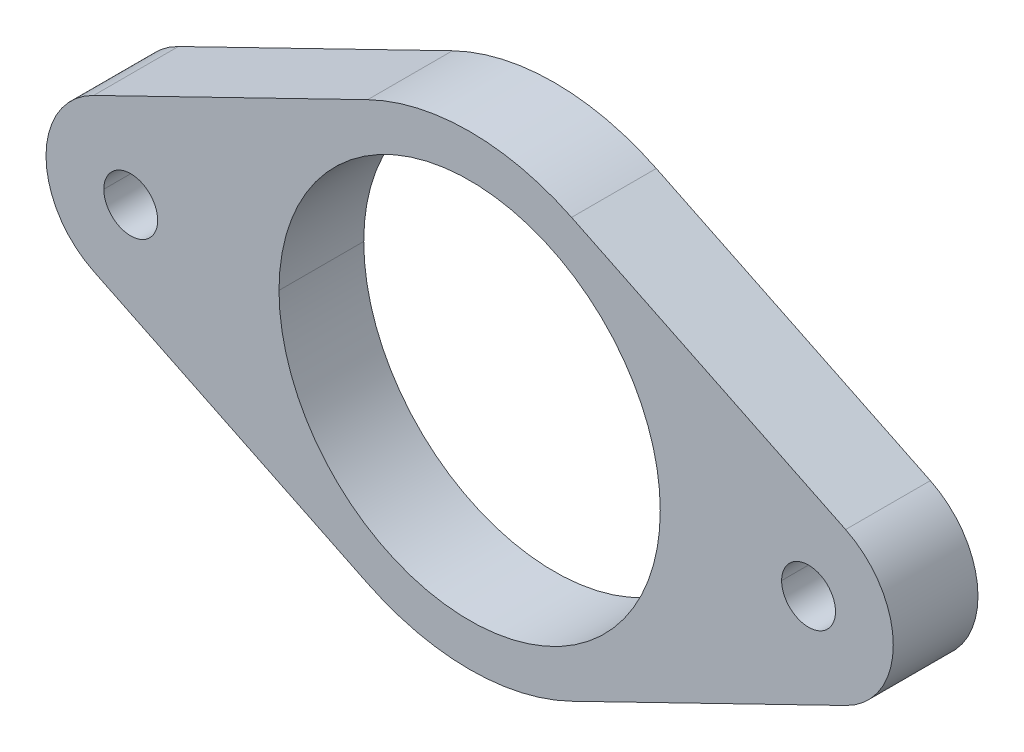
ISO-10303-21;
HEADER;
FILE_DESCRIPTION(('STEP AP214'),'2;1');
FILE_NAME('part.step','',(''),(''),'','','');
FILE_SCHEMA(('AUTOMOTIVE_DESIGN { 1 0 10303 214 1 1 1 1 }'));
ENDSEC;
DATA;
#1=APPLICATION_CONTEXT('core data for automotive mechanical design processes');
#2=APPLICATION_PROTOCOL_DEFINITION('international standard','automotive_design',2000,#1);
#3=PRODUCT_CONTEXT('',#1,'mechanical');
#4=PRODUCT('Part','Part','',(#3));
#5=PRODUCT_RELATED_PRODUCT_CATEGORY('part','',(#4));
#6=PRODUCT_DEFINITION_FORMATION('','',#4);
#7=PRODUCT_DEFINITION_CONTEXT('part definition',#1,'design');
#8=PRODUCT_DEFINITION('design','',#6,#7);
#9=PRODUCT_DEFINITION_SHAPE('','',#8);
#10=(LENGTH_UNIT() NAMED_UNIT(*) SI_UNIT(.MILLI.,.METRE.));
#11=(NAMED_UNIT(*) PLANE_ANGLE_UNIT() SI_UNIT($,.RADIAN.));
#12=(NAMED_UNIT(*) SI_UNIT($,.STERADIAN.) SOLID_ANGLE_UNIT());
#13=UNCERTAINTY_MEASURE_WITH_UNIT(LENGTH_MEASURE(1.E-05),#10,'distance_accuracy_value','');
#14=(GEOMETRIC_REPRESENTATION_CONTEXT(3) GLOBAL_UNCERTAINTY_ASSIGNED_CONTEXT((#13)) GLOBAL_UNIT_ASSIGNED_CONTEXT((#10,
#11,#12)) REPRESENTATION_CONTEXT('',''));
#15=CARTESIAN_POINT('',(0.,0.,0.));
#16=DIRECTION('',(0.,0.,1.));
#17=DIRECTION('',(1.,0.,0.));
#18=AXIS2_PLACEMENT_3D('',#15,#16,#17);
#19=CARTESIAN_POINT('',(-25.4,0.,3.175));
#20=DIRECTION('',(0.,0.,1.));
#21=DIRECTION('',(1.,0.,0.));
#22=AXIS2_PLACEMENT_3D('',#19,#20,#21);
#23=CYLINDRICAL_SURFACE('',#22,2.0193);
#24=DIRECTION('',(0.,0.,1.));
#25=VECTOR('',#24,1.);
#26=CARTESIAN_POINT('',(-27.4193,0.,3.175));
#27=LINE('',#26,#25);
#28=CARTESIAN_POINT('',(-27.4193,0.,-3.175));
#29=VERTEX_POINT('',#28);
#30=CARTESIAN_POINT('',(-27.4193,0.,3.175));
#31=VERTEX_POINT('',#30);
#32=EDGE_CURVE('E194',#29,#31,#27,.T.);
#33=ORIENTED_EDGE('',*,*,#32,.F.);
#34=CARTESIAN_POINT('',(-25.4,0.,-3.175));
#35=DIRECTION('',(0.,0.,1.));
#36=DIRECTION('',(1.,0.,0.));
#37=AXIS2_PLACEMENT_3D('',#34,#35,#36);
#38=CIRCLE('',#37,2.0193);
#39=CARTESIAN_POINT('',(-23.3807,0.,-3.175));
#40=VERTEX_POINT('',#39);
#41=EDGE_CURVE('E27',#40,#29,#38,.T.);
#42=ORIENTED_EDGE('',*,*,#41,.F.);
#43=DIRECTION('',(0.,0.,1.));
#44=VECTOR('',#43,1.);
#45=CARTESIAN_POINT('',(-23.3807,0.,3.175));
#46=LINE('',#45,#44);
#47=CARTESIAN_POINT('',(-23.3807,0.,3.175));
#48=VERTEX_POINT('',#47);
#49=EDGE_CURVE('E267',#40,#48,#46,.T.);
#50=ORIENTED_EDGE('',*,*,#49,.T.);
#51=CARTESIAN_POINT('',(-25.4,0.,3.175));
#52=DIRECTION('',(0.,0.,1.));
#53=DIRECTION('',(1.,0.,0.));
#54=AXIS2_PLACEMENT_3D('',#51,#52,#53);
#55=CIRCLE('',#54,2.0193);
#56=EDGE_CURVE('E247',#48,#31,#55,.T.);
#57=ORIENTED_EDGE('',*,*,#56,.T.);
#58=EDGE_LOOP('',(#33,#42,#50,#57));
#59=FACE_BOUND('',#58,.T.);
#60=ADVANCED_FACE('F16',(#59),#23,.F.);
#61=CARTESIAN_POINT('',(25.4,0.,3.175));
#62=DIRECTION('',(0.,0.,1.));
#63=DIRECTION('',(1.,0.,0.));
#64=AXIS2_PLACEMENT_3D('',#61,#62,#63);
#65=CYLINDRICAL_SURFACE('',#64,2.0193);
#66=DIRECTION('',(0.,0.,1.));
#67=VECTOR('',#66,1.);
#68=CARTESIAN_POINT('',(23.3807,0.,3.175));
#69=LINE('',#68,#67);
#70=CARTESIAN_POINT('',(23.3807,0.,-3.175));
#71=VERTEX_POINT('',#70);
#72=CARTESIAN_POINT('',(23.3807,0.,3.175));
#73=VERTEX_POINT('',#72);
#74=EDGE_CURVE('E266',#71,#73,#69,.T.);
#75=ORIENTED_EDGE('',*,*,#74,.F.);
#76=CARTESIAN_POINT('',(25.4,0.,-3.175));
#77=DIRECTION('',(0.,0.,1.));
#78=DIRECTION('',(1.,0.,0.));
#79=AXIS2_PLACEMENT_3D('',#76,#77,#78);
#80=CIRCLE('',#79,2.0193);
#81=CARTESIAN_POINT('',(27.4193,0.,-3.175));
#82=VERTEX_POINT('',#81);
#83=EDGE_CURVE('E11',#82,#71,#80,.T.);
#84=ORIENTED_EDGE('',*,*,#83,.F.);
#85=DIRECTION('',(0.,0.,1.));
#86=VECTOR('',#85,1.);
#87=CARTESIAN_POINT('',(27.4193,0.,3.175));
#88=LINE('',#87,#86);
#89=CARTESIAN_POINT('',(27.4193,0.,3.175));
#90=VERTEX_POINT('',#89);
#91=EDGE_CURVE('E181',#82,#90,#88,.T.);
#92=ORIENTED_EDGE('',*,*,#91,.T.);
#93=CARTESIAN_POINT('',(25.4,0.,3.175));
#94=DIRECTION('',(0.,0.,1.));
#95=DIRECTION('',(1.,0.,0.));
#96=AXIS2_PLACEMENT_3D('',#93,#94,#95);
#97=CIRCLE('',#96,2.0193);
#98=EDGE_CURVE('E301',#90,#73,#97,.T.);
#99=ORIENTED_EDGE('',*,*,#98,.T.);
#100=EDGE_LOOP('',(#75,#84,#92,#99));
#101=FACE_BOUND('',#100,.T.);
#102=ADVANCED_FACE('F372',(#101),#65,.F.);
#103=CARTESIAN_POINT('',(0.,0.,-3.175));
#104=DIRECTION('',(0.,0.,1.));
#105=DIRECTION('',(1.,0.,0.));
#106=AXIS2_PLACEMENT_3D('',#103,#104,#105);
#107=PLANE('',#106);
#108=CARTESIAN_POINT('',(0.,0.,-3.175));
#109=DIRECTION('',(0.,0.,1.));
#110=DIRECTION('',(1.,0.,0.));
#111=AXIS2_PLACEMENT_3D('',#108,#109,#110);
#112=CIRCLE('',#111,14.2875);
#113=CARTESIAN_POINT('',(-14.2875,0.,-3.175));
#114=VERTEX_POINT('',#113);
#115=CARTESIAN_POINT('',(14.2875,0.,-3.175));
#116=VERTEX_POINT('',#115);
#117=EDGE_CURVE('E176',#114,#116,#112,.T.);
#118=ORIENTED_EDGE('',*,*,#117,.T.);
#119=CARTESIAN_POINT('',(0.,0.,-3.175));
#120=DIRECTION('',(0.,0.,1.));
#121=DIRECTION('',(1.,0.,0.));
#122=AXIS2_PLACEMENT_3D('',#119,#120,#121);
#123=CIRCLE('',#122,14.2875);
#124=EDGE_CURVE('E166',#116,#114,#123,.T.);
#125=ORIENTED_EDGE('',*,*,#124,.T.);
#126=EDGE_LOOP('',(#118,#125));
#127=FACE_BOUND('',#126,.T.);
#128=ORIENTED_EDGE('',*,*,#83,.T.);
#129=CARTESIAN_POINT('',(25.4,0.,-3.175));
#130=DIRECTION('',(0.,0.,1.));
#131=DIRECTION('',(1.,0.,0.));
#132=AXIS2_PLACEMENT_3D('',#129,#130,#131);
#133=CIRCLE('',#132,2.0193);
#134=EDGE_CURVE('E262',#71,#82,#133,.T.);
#135=ORIENTED_EDGE('',*,*,#134,.T.);
#136=EDGE_LOOP('',(#128,#135));
#137=FACE_BOUND('',#136,.T.);
#138=ORIENTED_EDGE('',*,*,#41,.T.);
#139=CARTESIAN_POINT('',(-25.4,0.,-3.175));
#140=DIRECTION('',(0.,0.,1.));
#141=DIRECTION('',(1.,0.,0.));
#142=AXIS2_PLACEMENT_3D('',#139,#140,#141);
#143=CIRCLE('',#142,2.0193);
#144=EDGE_CURVE('E198',#29,#40,#143,.T.);
#145=ORIENTED_EDGE('',*,*,#144,.T.);
#146=EDGE_LOOP('',(#138,#145));
#147=FACE_BOUND('',#146,.T.);
#148=DIRECTION('',(-0.899218410621135,0.4375,0.));
#149=VECTOR('',#148,1.);
#150=CARTESIAN_POINT('',(7.63984375,15.7026014954715,-3.175));
#151=LINE('',#150,#149);
#152=CARTESIAN_POINT('',(28.178125,5.71003690744421,-3.175));
#153=VERTEX_POINT('',#152);
#154=CARTESIAN_POINT('',(7.63984375,15.7026014954715,-3.175));
#155=VERTEX_POINT('',#154);
#156=EDGE_CURVE('E199',#153,#155,#151,.T.);
#157=ORIENTED_EDGE('',*,*,#156,.F.);
#158=CARTESIAN_POINT('',(25.4,0.,-3.175));
#159=DIRECTION('',(0.,0.,1.));
#160=DIRECTION('',(1.,0.,0.));
#161=AXIS2_PLACEMENT_3D('',#158,#159,#160);
#162=CIRCLE('',#161,6.35);
#163=CARTESIAN_POINT('',(28.178125,-5.71003690744421,-3.175));
#164=VERTEX_POINT('',#163);
#165=EDGE_CURVE('E248',#164,#153,#162,.T.);
#166=ORIENTED_EDGE('',*,*,#165,.F.);
#167=DIRECTION('',(-0.899218410621135,-0.4375,0.));
#168=VECTOR('',#167,1.);
#169=CARTESIAN_POINT('',(7.63984375,-15.7026014954715,-3.175));
#170=LINE('',#169,#168);
#171=CARTESIAN_POINT('',(7.63984375,-15.7026014954715,-3.175));
#172=VERTEX_POINT('',#171);
#173=EDGE_CURVE('E228',#164,#172,#170,.T.);
#174=ORIENTED_EDGE('',*,*,#173,.T.);
#175=CARTESIAN_POINT('',(0.,0.,-3.175));
#176=DIRECTION('',(0.,0.,1.));
#177=DIRECTION('',(1.,0.,0.));
#178=AXIS2_PLACEMENT_3D('',#175,#176,#177);
#179=CIRCLE('',#178,17.4625);
#180=CARTESIAN_POINT('',(-7.63984375,-15.7026014954715,-3.175));
#181=VERTEX_POINT('',#180);
#182=EDGE_CURVE('E284',#181,#172,#179,.T.);
#183=ORIENTED_EDGE('',*,*,#182,.F.);
#184=DIRECTION('',(-0.899218410621135,0.4375,0.));
#185=VECTOR('',#184,1.);
#186=CARTESIAN_POINT('',(-7.63984375,-15.7026014954715,-3.175));
#187=LINE('',#186,#185);
#188=CARTESIAN_POINT('',(-28.178125,-5.71003690744421,-3.175));
#189=VERTEX_POINT('',#188);
#190=EDGE_CURVE('E258',#181,#189,#187,.T.);
#191=ORIENTED_EDGE('',*,*,#190,.T.);
#192=CARTESIAN_POINT('',(-25.4,0.,-3.175));
#193=DIRECTION('',(0.,0.,1.));
#194=DIRECTION('',(1.,0.,0.));
#195=AXIS2_PLACEMENT_3D('',#192,#193,#194);
#196=CIRCLE('',#195,6.35);
#197=CARTESIAN_POINT('',(-31.75,0.,-3.175));
#198=VERTEX_POINT('',#197);
#199=EDGE_CURVE('E215',#198,#189,#196,.T.);
#200=ORIENTED_EDGE('',*,*,#199,.F.);
#201=CARTESIAN_POINT('',(-25.4,0.,-3.175));
#202=DIRECTION('',(0.,0.,1.));
#203=DIRECTION('',(1.,0.,0.));
#204=AXIS2_PLACEMENT_3D('',#201,#202,#203);
#205=CIRCLE('',#204,6.35);
#206=CARTESIAN_POINT('',(-28.178125,5.71003690744421,-3.175));
#207=VERTEX_POINT('',#206);
#208=EDGE_CURVE('E261',#207,#198,#205,.T.);
#209=ORIENTED_EDGE('',*,*,#208,.F.);
#210=DIRECTION('',(0.899218410621135,0.4375,0.));
#211=VECTOR('',#210,1.);
#212=CARTESIAN_POINT('',(-7.63984375,15.7026014954715,-3.175));
#213=LINE('',#212,#211);
#214=CARTESIAN_POINT('',(-7.63984375,15.7026014954715,-3.175));
#215=VERTEX_POINT('',#214);
#216=EDGE_CURVE('E241',#207,#215,#213,.T.);
#217=ORIENTED_EDGE('',*,*,#216,.T.);
#218=CARTESIAN_POINT('',(0.,0.,-3.175));
#219=DIRECTION('',(0.,0.,1.));
#220=DIRECTION('',(1.,0.,0.));
#221=AXIS2_PLACEMENT_3D('',#218,#219,#220);
#222=CIRCLE('',#221,17.4625);
#223=EDGE_CURVE('E238',#155,#215,#222,.T.);
#224=ORIENTED_EDGE('',*,*,#223,.F.);
#225=EDGE_LOOP('',(#157,#166,#174,#183,#191,#200,#209,#217,#224));
#226=FACE_BOUND('',#225,.T.);
#227=ADVANCED_FACE('F320',(#127,#137,#147,#226),#107,.F.);
#228=CARTESIAN_POINT('',(0.,0.,3.175));
#229=DIRECTION('',(0.,0.,1.));
#230=DIRECTION('',(1.,0.,0.));
#231=AXIS2_PLACEMENT_3D('',#228,#229,#230);
#232=PLANE('',#231);
#233=CARTESIAN_POINT('',(0.,0.,3.175));
#234=DIRECTION('',(0.,0.,1.));
#235=DIRECTION('',(1.,0.,0.));
#236=AXIS2_PLACEMENT_3D('',#233,#234,#235);
#237=CIRCLE('',#236,14.2875);
#238=CARTESIAN_POINT('',(-14.2875,0.,3.175));
#239=VERTEX_POINT('',#238);
#240=CARTESIAN_POINT('',(14.2875,0.,3.175));
#241=VERTEX_POINT('',#240);
#242=EDGE_CURVE('E161',#239,#241,#237,.T.);
#243=ORIENTED_EDGE('',*,*,#242,.F.);
#244=CARTESIAN_POINT('',(0.,0.,3.175));
#245=DIRECTION('',(0.,0.,1.));
#246=DIRECTION('',(1.,0.,0.));
#247=AXIS2_PLACEMENT_3D('',#244,#245,#246);
#248=CIRCLE('',#247,14.2875);
#249=EDGE_CURVE('E156',#241,#239,#248,.T.);
#250=ORIENTED_EDGE('',*,*,#249,.F.);
#251=EDGE_LOOP('',(#243,#250));
#252=FACE_BOUND('',#251,.T.);
#253=ORIENTED_EDGE('',*,*,#98,.F.);
#254=CARTESIAN_POINT('',(25.4,0.,3.175));
#255=DIRECTION('',(0.,0.,1.));
#256=DIRECTION('',(1.,0.,0.));
#257=AXIS2_PLACEMENT_3D('',#254,#255,#256);
#258=CIRCLE('',#257,2.0193);
#259=EDGE_CURVE('E188',#73,#90,#258,.T.);
#260=ORIENTED_EDGE('',*,*,#259,.F.);
#261=EDGE_LOOP('',(#253,#260));
#262=FACE_BOUND('',#261,.T.);
#263=ORIENTED_EDGE('',*,*,#56,.F.);
#264=CARTESIAN_POINT('',(-25.4,0.,3.175));
#265=DIRECTION('',(0.,0.,1.));
#266=DIRECTION('',(1.,0.,0.));
#267=AXIS2_PLACEMENT_3D('',#264,#265,#266);
#268=CIRCLE('',#267,2.0193);
#269=EDGE_CURVE('E197',#31,#48,#268,.T.);
#270=ORIENTED_EDGE('',*,*,#269,.F.);
#271=EDGE_LOOP('',(#263,#270));
#272=FACE_BOUND('',#271,.T.);
#273=DIRECTION('',(-0.899218410621135,0.4375,0.));
#274=VECTOR('',#273,1.);
#275=CARTESIAN_POINT('',(7.63984375,15.7026014954715,3.175));
#276=LINE('',#275,#274);
#277=CARTESIAN_POINT('',(28.178125,5.71003690744421,3.175));
#278=VERTEX_POINT('',#277);
#279=CARTESIAN_POINT('',(7.63984375,15.7026014954715,3.175));
#280=VERTEX_POINT('',#279);
#281=EDGE_CURVE('E213',#278,#280,#276,.T.);
#282=ORIENTED_EDGE('',*,*,#281,.T.);
#283=CARTESIAN_POINT('',(0.,0.,3.175));
#284=DIRECTION('',(0.,0.,1.));
#285=DIRECTION('',(1.,0.,0.));
#286=AXIS2_PLACEMENT_3D('',#283,#284,#285);
#287=CIRCLE('',#286,17.4625);
#288=CARTESIAN_POINT('',(-7.63984375,15.7026014954715,3.175));
#289=VERTEX_POINT('',#288);
#290=EDGE_CURVE('E237',#280,#289,#287,.T.);
#291=ORIENTED_EDGE('',*,*,#290,.T.);
#292=DIRECTION('',(0.899218410621135,0.4375,0.));
#293=VECTOR('',#292,1.);
#294=CARTESIAN_POINT('',(-7.63984375,15.7026014954715,3.175));
#295=LINE('',#294,#293);
#296=CARTESIAN_POINT('',(-28.178125,5.71003690744421,3.175));
#297=VERTEX_POINT('',#296);
#298=EDGE_CURVE('E288',#297,#289,#295,.T.);
#299=ORIENTED_EDGE('',*,*,#298,.F.);
#300=CARTESIAN_POINT('',(-25.4,0.,3.175));
#301=DIRECTION('',(0.,0.,1.));
#302=DIRECTION('',(1.,0.,0.));
#303=AXIS2_PLACEMENT_3D('',#300,#301,#302);
#304=CIRCLE('',#303,6.35);
#305=CARTESIAN_POINT('',(-31.75,0.,3.175));
#306=VERTEX_POINT('',#305);
#307=EDGE_CURVE('E20',#297,#306,#304,.T.);
#308=ORIENTED_EDGE('',*,*,#307,.T.);
#309=CARTESIAN_POINT('',(-25.4,0.,3.175));
#310=DIRECTION('',(0.,0.,1.));
#311=DIRECTION('',(1.,0.,0.));
#312=AXIS2_PLACEMENT_3D('',#309,#310,#311);
#313=CIRCLE('',#312,6.35);
#314=CARTESIAN_POINT('',(-28.178125,-5.71003690744421,3.175));
#315=VERTEX_POINT('',#314);
#316=EDGE_CURVE('E252',#306,#315,#313,.T.);
#317=ORIENTED_EDGE('',*,*,#316,.T.);
#318=DIRECTION('',(-0.899218410621135,0.4375,0.));
#319=VECTOR('',#318,1.);
#320=CARTESIAN_POINT('',(-7.63984375,-15.7026014954715,3.175));
#321=LINE('',#320,#319);
#322=CARTESIAN_POINT('',(-7.63984375,-15.7026014954715,3.175));
#323=VERTEX_POINT('',#322);
#324=EDGE_CURVE('E257',#323,#315,#321,.T.);
#325=ORIENTED_EDGE('',*,*,#324,.F.);
#326=CARTESIAN_POINT('',(0.,0.,3.175));
#327=DIRECTION('',(0.,0.,1.));
#328=DIRECTION('',(1.,0.,0.));
#329=AXIS2_PLACEMENT_3D('',#326,#327,#328);
#330=CIRCLE('',#329,17.4625);
#331=CARTESIAN_POINT('',(7.63984375,-15.7026014954715,3.175));
#332=VERTEX_POINT('',#331);
#333=EDGE_CURVE('E283',#323,#332,#330,.T.);
#334=ORIENTED_EDGE('',*,*,#333,.T.);
#335=DIRECTION('',(-0.899218410621135,-0.4375,0.));
#336=VECTOR('',#335,1.);
#337=CARTESIAN_POINT('',(7.63984375,-15.7026014954715,3.175));
#338=LINE('',#337,#336);
#339=CARTESIAN_POINT('',(28.178125,-5.71003690744421,3.175));
#340=VERTEX_POINT('',#339);
#341=EDGE_CURVE('E167',#340,#332,#338,.T.);
#342=ORIENTED_EDGE('',*,*,#341,.F.);
#343=CARTESIAN_POINT('',(25.4,0.,3.175));
#344=DIRECTION('',(0.,0.,1.));
#345=DIRECTION('',(1.,0.,0.));
#346=AXIS2_PLACEMENT_3D('',#343,#344,#345);
#347=CIRCLE('',#346,6.35);
#348=EDGE_CURVE('E41',#340,#278,#347,.T.);
#349=ORIENTED_EDGE('',*,*,#348,.T.);
#350=EDGE_LOOP('',(#282,#291,#299,#308,#317,#325,#334,#342,#349));
#351=FACE_BOUND('',#350,.T.);
#352=ADVANCED_FACE('F158',(#252,#262,#272,#351),#232,.T.);
#353=CARTESIAN_POINT('',(25.4,0.,3.175));
#354=DIRECTION('',(0.,0.,-1.));
#355=DIRECTION('',(-1.,0.,0.));
#356=AXIS2_PLACEMENT_3D('',#353,#354,#355);
#357=CYLINDRICAL_SURFACE('',#356,6.35);
#358=ORIENTED_EDGE('',*,*,#165,.T.);
#359=DIRECTION('',(0.,0.,-1.));
#360=VECTOR('',#359,1.);
#361=CARTESIAN_POINT('',(28.178125,5.71003690744421,3.175));
#362=LINE('',#361,#360);
#363=EDGE_CURVE('E327',#278,#153,#362,.T.);
#364=ORIENTED_EDGE('',*,*,#363,.F.);
#365=ORIENTED_EDGE('',*,*,#348,.F.);
#366=DIRECTION('',(0.,0.,-1.));
#367=VECTOR('',#366,1.);
#368=CARTESIAN_POINT('',(28.178125,-5.71003690744421,3.175));
#369=LINE('',#368,#367);
#370=EDGE_CURVE('E230',#340,#164,#369,.T.);
#371=ORIENTED_EDGE('',*,*,#370,.T.);
#372=EDGE_LOOP('',(#358,#364,#365,#371));
#373=FACE_BOUND('',#372,.T.);
#374=ADVANCED_FACE('F319',(#373),#357,.T.);
#375=CARTESIAN_POINT('',(0.,0.,3.175));
#376=DIRECTION('',(0.,0.,-1.));
#377=DIRECTION('',(-1.,0.,0.));
#378=AXIS2_PLACEMENT_3D('',#375,#376,#377);
#379=CYLINDRICAL_SURFACE('',#378,14.2875);
#380=DIRECTION('',(0.,0.,-1.));
#381=VECTOR('',#380,1.);
#382=CARTESIAN_POINT('',(14.2875,0.,3.175));
#383=LINE('',#382,#381);
#384=EDGE_CURVE('E170',#241,#116,#383,.T.);
#385=ORIENTED_EDGE('',*,*,#384,.F.);
#386=ORIENTED_EDGE('',*,*,#249,.T.);
#387=DIRECTION('',(0.,0.,-1.));
#388=VECTOR('',#387,1.);
#389=CARTESIAN_POINT('',(-14.2875,0.,3.175));
#390=LINE('',#389,#388);
#391=EDGE_CURVE('E179',#239,#114,#390,.T.);
#392=ORIENTED_EDGE('',*,*,#391,.T.);
#393=ORIENTED_EDGE('',*,*,#124,.F.);
#394=EDGE_LOOP('',(#385,#386,#392,#393));
#395=FACE_BOUND('',#394,.T.);
#396=ADVANCED_FACE('F171',(#395),#379,.F.);
#397=CARTESIAN_POINT('',(7.63984375,-15.7026014954715,3.175));
#398=DIRECTION('',(0.4375,-0.899218410621135,0.));
#399=DIRECTION('',(0.,0.,-1.));
#400=AXIS2_PLACEMENT_3D('',#397,#398,#399);
#401=PLANE('',#400);
#402=ORIENTED_EDGE('',*,*,#173,.F.);
#403=ORIENTED_EDGE('',*,*,#370,.F.);
#404=ORIENTED_EDGE('',*,*,#341,.T.);
#405=DIRECTION('',(0.,0.,-1.));
#406=VECTOR('',#405,1.);
#407=CARTESIAN_POINT('',(7.63984375,-15.7026014954715,3.175));
#408=LINE('',#407,#406);
#409=EDGE_CURVE('E279',#332,#172,#408,.T.);
#410=ORIENTED_EDGE('',*,*,#409,.T.);
#411=EDGE_LOOP('',(#402,#403,#404,#410));
#412=FACE_BOUND('',#411,.T.);
#413=ADVANCED_FACE('F453',(#412),#401,.T.);
#414=CARTESIAN_POINT('',(0.,0.,3.175));
#415=DIRECTION('',(0.,0.,-1.));
#416=DIRECTION('',(-1.,0.,0.));
#417=AXIS2_PLACEMENT_3D('',#414,#415,#416);
#418=CYLINDRICAL_SURFACE('',#417,17.4625);
#419=ORIENTED_EDGE('',*,*,#182,.T.);
#420=ORIENTED_EDGE('',*,*,#409,.F.);
#421=ORIENTED_EDGE('',*,*,#333,.F.);
#422=DIRECTION('',(0.,0.,-1.));
#423=VECTOR('',#422,1.);
#424=CARTESIAN_POINT('',(-7.63984375,-15.7026014954715,3.175));
#425=LINE('',#424,#423);
#426=EDGE_CURVE('E253',#323,#181,#425,.T.);
#427=ORIENTED_EDGE('',*,*,#426,.T.);
#428=EDGE_LOOP('',(#419,#420,#421,#427));
#429=FACE_BOUND('',#428,.T.);
#430=ADVANCED_FACE('F351',(#429),#418,.T.);
#431=CARTESIAN_POINT('',(-7.63984375,-15.7026014954715,3.175));
#432=DIRECTION('',(-0.4375,-0.899218410621135,0.));
#433=DIRECTION('',(-0.899218410621135,0.4375,0.));
#434=AXIS2_PLACEMENT_3D('',#431,#432,#433);
#435=PLANE('',#434);
#436=ORIENTED_EDGE('',*,*,#190,.F.);
#437=ORIENTED_EDGE('',*,*,#426,.F.);
#438=ORIENTED_EDGE('',*,*,#324,.T.);
#439=DIRECTION('',(0.,0.,-1.));
#440=VECTOR('',#439,1.);
#441=CARTESIAN_POINT('',(-28.178125,-5.71003690744421,3.175));
#442=LINE('',#441,#440);
#443=EDGE_CURVE('E203',#315,#189,#442,.T.);
#444=ORIENTED_EDGE('',*,*,#443,.T.);
#445=EDGE_LOOP('',(#436,#437,#438,#444));
#446=FACE_BOUND('',#445,.T.);
#447=ADVANCED_FACE('F349',(#446),#435,.T.);
#448=CARTESIAN_POINT('',(-25.4,0.,3.175));
#449=DIRECTION('',(0.,0.,-1.));
#450=DIRECTION('',(-1.,0.,0.));
#451=AXIS2_PLACEMENT_3D('',#448,#449,#450);
#452=CYLINDRICAL_SURFACE('',#451,6.35);
#453=DIRECTION('',(0.,0.,-1.));
#454=VECTOR('',#453,1.);
#455=CARTESIAN_POINT('',(-31.75,0.,3.175));
#456=LINE('',#455,#454);
#457=EDGE_CURVE('E224',#306,#198,#456,.T.);
#458=ORIENTED_EDGE('',*,*,#457,.F.);
#459=ORIENTED_EDGE('',*,*,#307,.F.);
#460=DIRECTION('',(0.,0.,-1.));
#461=VECTOR('',#460,1.);
#462=CARTESIAN_POINT('',(-28.178125,5.71003690744421,3.175));
#463=LINE('',#462,#461);
#464=EDGE_CURVE('E244',#297,#207,#463,.T.);
#465=ORIENTED_EDGE('',*,*,#464,.T.);
#466=ORIENTED_EDGE('',*,*,#208,.T.);
#467=EDGE_LOOP('',(#458,#459,#465,#466));
#468=FACE_BOUND('',#467,.T.);
#469=ADVANCED_FACE('F342',(#468),#452,.T.);
#470=CARTESIAN_POINT('',(-7.63984375,15.7026014954715,3.175));
#471=DIRECTION('',(-0.4375,0.899218410621135,0.));
#472=DIRECTION('',(0.,0.,1.));
#473=AXIS2_PLACEMENT_3D('',#470,#471,#472);
#474=PLANE('',#473);
#475=ORIENTED_EDGE('',*,*,#216,.F.);
#476=ORIENTED_EDGE('',*,*,#464,.F.);
#477=ORIENTED_EDGE('',*,*,#298,.T.);
#478=DIRECTION('',(0.,0.,-1.));
#479=VECTOR('',#478,1.);
#480=CARTESIAN_POINT('',(-7.63984375,15.7026014954715,3.175));
#481=LINE('',#480,#479);
#482=EDGE_CURVE('E233',#289,#215,#481,.T.);
#483=ORIENTED_EDGE('',*,*,#482,.T.);
#484=EDGE_LOOP('',(#475,#476,#477,#483));
#485=FACE_BOUND('',#484,.T.);
#486=ADVANCED_FACE('F334',(#485),#474,.T.);
#487=CARTESIAN_POINT('',(0.,0.,3.175));
#488=DIRECTION('',(0.,0.,-1.));
#489=DIRECTION('',(-1.,0.,0.));
#490=AXIS2_PLACEMENT_3D('',#487,#488,#489);
#491=CYLINDRICAL_SURFACE('',#490,17.4625);
#492=ORIENTED_EDGE('',*,*,#223,.T.);
#493=ORIENTED_EDGE('',*,*,#482,.F.);
#494=ORIENTED_EDGE('',*,*,#290,.F.);
#495=DIRECTION('',(0.,0.,-1.));
#496=VECTOR('',#495,1.);
#497=CARTESIAN_POINT('',(7.63984375,15.7026014954715,3.175));
#498=LINE('',#497,#496);
#499=EDGE_CURVE('E202',#280,#155,#498,.T.);
#500=ORIENTED_EDGE('',*,*,#499,.T.);
#501=EDGE_LOOP('',(#492,#493,#494,#500));
#502=FACE_BOUND('',#501,.T.);
#503=ADVANCED_FACE('F18',(#502),#491,.T.);
#504=CARTESIAN_POINT('',(7.63984375,15.7026014954715,3.175));
#505=DIRECTION('',(-0.4375,-0.899218410621135,0.));
#506=DIRECTION('',(-0.899218410621135,0.4375,0.));
#507=AXIS2_PLACEMENT_3D('',#504,#505,#506);
#508=PLANE('',#507);
#509=ORIENTED_EDGE('',*,*,#156,.T.);
#510=ORIENTED_EDGE('',*,*,#499,.F.);
#511=ORIENTED_EDGE('',*,*,#281,.F.);
#512=ORIENTED_EDGE('',*,*,#363,.T.);
#513=EDGE_LOOP('',(#509,#510,#511,#512));
#514=FACE_BOUND('',#513,.T.);
#515=ADVANCED_FACE('F329',(#514),#508,.F.);
#516=CARTESIAN_POINT('',(-25.4,0.,3.175));
#517=DIRECTION('',(0.,0.,-1.));
#518=DIRECTION('',(-1.,0.,0.));
#519=AXIS2_PLACEMENT_3D('',#516,#517,#518);
#520=CYLINDRICAL_SURFACE('',#519,6.35);
#521=ORIENTED_EDGE('',*,*,#316,.F.);
#522=ORIENTED_EDGE('',*,*,#457,.T.);
#523=ORIENTED_EDGE('',*,*,#199,.T.);
#524=ORIENTED_EDGE('',*,*,#443,.F.);
#525=EDGE_LOOP('',(#521,#522,#523,#524));
#526=FACE_BOUND('',#525,.T.);
#527=ADVANCED_FACE('F345',(#526),#520,.T.);
#528=CARTESIAN_POINT('',(0.,0.,3.175));
#529=DIRECTION('',(0.,0.,-1.));
#530=DIRECTION('',(-1.,0.,0.));
#531=AXIS2_PLACEMENT_3D('',#528,#529,#530);
#532=CYLINDRICAL_SURFACE('',#531,14.2875);
#533=ORIENTED_EDGE('',*,*,#242,.T.);
#534=ORIENTED_EDGE('',*,*,#384,.T.);
#535=ORIENTED_EDGE('',*,*,#117,.F.);
#536=ORIENTED_EDGE('',*,*,#391,.F.);
#537=EDGE_LOOP('',(#533,#534,#535,#536));
#538=FACE_BOUND('',#537,.T.);
#539=ADVANCED_FACE('F178',(#538),#532,.F.);
#540=CARTESIAN_POINT('',(25.4,0.,3.175));
#541=DIRECTION('',(0.,0.,1.));
#542=DIRECTION('',(1.,0.,0.));
#543=AXIS2_PLACEMENT_3D('',#540,#541,#542);
#544=CYLINDRICAL_SURFACE('',#543,2.0193);
#545=ORIENTED_EDGE('',*,*,#134,.F.);
#546=ORIENTED_EDGE('',*,*,#74,.T.);
#547=ORIENTED_EDGE('',*,*,#259,.T.);
#548=ORIENTED_EDGE('',*,*,#91,.F.);
#549=EDGE_LOOP('',(#545,#546,#547,#548));
#550=FACE_BOUND('',#549,.T.);
#551=ADVANCED_FACE('F369',(#550),#544,.F.);
#552=CARTESIAN_POINT('',(-25.4,0.,3.175));
#553=DIRECTION('',(0.,0.,1.));
#554=DIRECTION('',(1.,0.,0.));
#555=AXIS2_PLACEMENT_3D('',#552,#553,#554);
#556=CYLINDRICAL_SURFACE('',#555,2.0193);
#557=ORIENTED_EDGE('',*,*,#144,.F.);
#558=ORIENTED_EDGE('',*,*,#32,.T.);
#559=ORIENTED_EDGE('',*,*,#269,.T.);
#560=ORIENTED_EDGE('',*,*,#49,.F.);
#561=EDGE_LOOP('',(#557,#558,#559,#560));
#562=FACE_BOUND('',#561,.T.);
#563=ADVANCED_FACE('F315',(#562),#556,.F.);
#564=CLOSED_SHELL('',(#60,#102,#227,#352,#374,#396,#413,#430,#447,#469,#486,#503,#515,#527,#539,
#551,#563));
#565=MANIFOLD_SOLID_BREP('B1',#564);
#566=ADVANCED_BREP_SHAPE_REPRESENTATION('',(#18,#565),#14);
#567=SHAPE_DEFINITION_REPRESENTATION(#9,#566);
ENDSEC;
END-ISO-10303-21;
